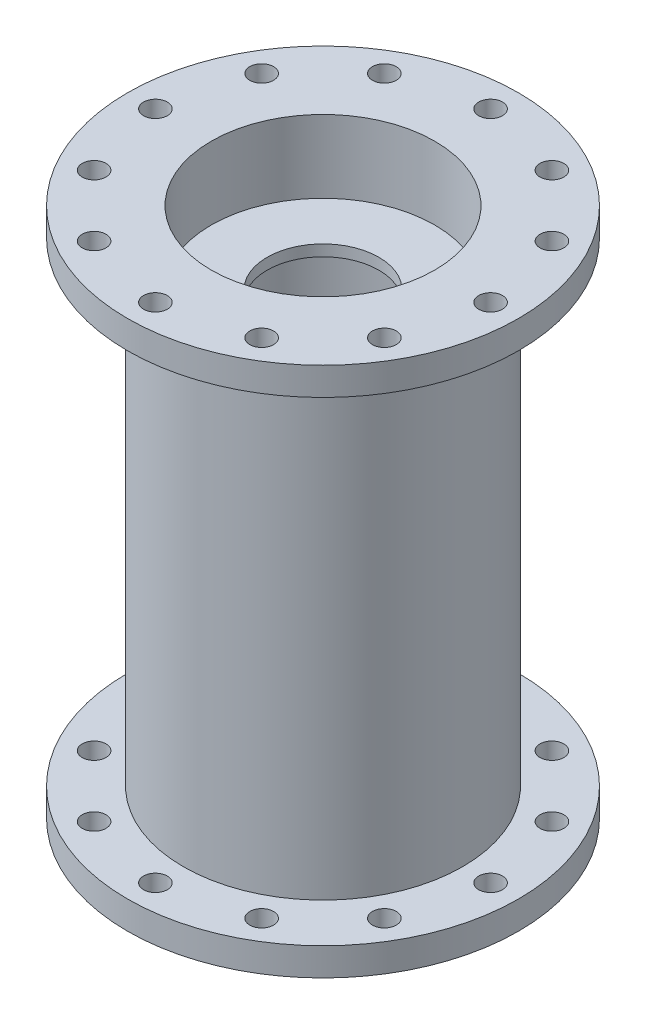
ISO-10303-21;
HEADER;
FILE_DESCRIPTION(('STEP AP214'),'2;1');
FILE_NAME('part.step','',(''),(''),'','','');
FILE_SCHEMA(('AUTOMOTIVE_DESIGN { 1 0 10303 214 1 1 1 1 }'));
ENDSEC;
DATA;
#1=APPLICATION_CONTEXT('core data for automotive mechanical design processes');
#2=APPLICATION_PROTOCOL_DEFINITION('international standard','automotive_design',2000,#1);
#3=PRODUCT_CONTEXT('',#1,'mechanical');
#4=PRODUCT('Part','Part','',(#3));
#5=PRODUCT_RELATED_PRODUCT_CATEGORY('part','',(#4));
#6=PRODUCT_DEFINITION_FORMATION('','',#4);
#7=PRODUCT_DEFINITION_CONTEXT('part definition',#1,'design');
#8=PRODUCT_DEFINITION('design','',#6,#7);
#9=PRODUCT_DEFINITION_SHAPE('','',#8);
#10=(LENGTH_UNIT() NAMED_UNIT(*) SI_UNIT(.MILLI.,.METRE.));
#11=(NAMED_UNIT(*) PLANE_ANGLE_UNIT() SI_UNIT($,.RADIAN.));
#12=(NAMED_UNIT(*) SI_UNIT($,.STERADIAN.) SOLID_ANGLE_UNIT());
#13=UNCERTAINTY_MEASURE_WITH_UNIT(LENGTH_MEASURE(1.E-05),#10,'distance_accuracy_value','');
#14=(GEOMETRIC_REPRESENTATION_CONTEXT(3) GLOBAL_UNCERTAINTY_ASSIGNED_CONTEXT((#13)) GLOBAL_UNIT_ASSIGNED_CONTEXT((#10,
#11,#12)) REPRESENTATION_CONTEXT('',''));
#15=CARTESIAN_POINT('',(0.,0.,0.));
#16=DIRECTION('',(0.,0.,1.));
#17=DIRECTION('',(1.,0.,0.));
#18=AXIS2_PLACEMENT_3D('',#15,#16,#17);
#19=CARTESIAN_POINT('',(0.,0.,0.));
#20=DIRECTION('',(0.,-1.,0.));
#21=DIRECTION('',(0.,0.,-1.));
#22=AXIS2_PLACEMENT_3D('',#19,#20,#21);
#23=CYLINDRICAL_SURFACE('',#22,25.4);
#24=CARTESIAN_POINT('',(0.,101.6,0.));
#25=DIRECTION('',(0.,-1.,0.));
#26=DIRECTION('',(0.,0.,-1.));
#27=AXIS2_PLACEMENT_3D('',#24,#25,#26);
#28=CIRCLE('',#27,25.4);
#29=CARTESIAN_POINT('',(0.,101.6,-25.4));
#30=VERTEX_POINT('',#29);
#31=EDGE_CURVE('E10',#30,#30,#28,.T.);
#32=ORIENTED_EDGE('',*,*,#31,.F.);
#33=EDGE_LOOP('',(#32));
#34=FACE_BOUND('',#33,.T.);
#35=CARTESIAN_POINT('',(0.,19.05,0.));
#36=DIRECTION('',(0.,1.,0.));
#37=DIRECTION('',(0.,0.,1.));
#38=AXIS2_PLACEMENT_3D('',#35,#36,#37);
#39=CIRCLE('',#38,25.4);
#40=CARTESIAN_POINT('',(0.,19.05,25.4));
#41=VERTEX_POINT('',#40);
#42=EDGE_CURVE('E56',#41,#41,#39,.T.);
#43=ORIENTED_EDGE('',*,*,#42,.F.);
#44=EDGE_LOOP('',(#43));
#45=FACE_BOUND('',#44,.T.);
#46=ADVANCED_FACE('F43',(#34,#45),#23,.F.);
#47=CARTESIAN_POINT('',(0.,104.14,0.));
#48=DIRECTION('',(0.,1.,0.));
#49=DIRECTION('',(0.,0.,1.));
#50=AXIS2_PLACEMENT_3D('',#47,#48,#49);
#51=CIRCLE('',#50,25.4);
#52=CARTESIAN_POINT('',(0.,104.14,25.4));
#53=VERTEX_POINT('',#52);
#54=EDGE_CURVE('E51',#53,#53,#51,.T.);
#55=ORIENTED_EDGE('',*,*,#54,.F.);
#56=EDGE_LOOP('',(#55));
#57=FACE_BOUND('',#56,.T.);
#58=CARTESIAN_POINT('',(0.,120.65,0.));
#59=DIRECTION('',(0.,-1.,0.));
#60=DIRECTION('',(0.,0.,-1.));
#61=AXIS2_PLACEMENT_3D('',#58,#59,#60);
#62=CIRCLE('',#61,25.4);
#63=CARTESIAN_POINT('',(0.,120.65,-25.4));
#64=VERTEX_POINT('',#63);
#65=EDGE_CURVE('E91',#64,#64,#62,.T.);
#66=ORIENTED_EDGE('',*,*,#65,.F.);
#67=EDGE_LOOP('',(#66));
#68=FACE_BOUND('',#67,.T.);
#69=ADVANCED_FACE('F374',(#57,#68),#23,.F.);
#70=CARTESIAN_POINT('',(0.,0.,-31.75));
#71=DIRECTION('',(0.,-1.,0.));
#72=DIRECTION('',(0.,0.,-1.));
#73=AXIS2_PLACEMENT_3D('',#70,#71,#72);
#74=PLANE('',#73);
#75=CARTESIAN_POINT('',(-38.1,0.,0.));
#76=DIRECTION('',(0.,1.,0.));
#77=DIRECTION('',(0.,0.,1.));
#78=AXIS2_PLACEMENT_3D('',#75,#76,#77);
#79=CIRCLE('',#78,2.70509999999999);
#80=CARTESIAN_POINT('',(-38.1,0.,2.70509999999998));
#81=VERTEX_POINT('',#80);
#82=EDGE_CURVE('E299',#81,#81,#79,.T.);
#83=ORIENTED_EDGE('',*,*,#82,.T.);
#84=EDGE_LOOP('',(#83));
#85=FACE_BOUND('',#84,.T.);
#86=CARTESIAN_POINT('',(-32.9955678841871,0.,-19.05));
#87=DIRECTION('',(0.,1.,0.));
#88=DIRECTION('',(0.,0.,1.));
#89=AXIS2_PLACEMENT_3D('',#86,#87,#88);
#90=CIRCLE('',#89,2.70509999999998);
#91=CARTESIAN_POINT('',(-32.9955678841871,0.,-16.3449));
#92=VERTEX_POINT('',#91);
#93=EDGE_CURVE('E283',#92,#92,#90,.T.);
#94=ORIENTED_EDGE('',*,*,#93,.T.);
#95=EDGE_LOOP('',(#94));
#96=FACE_BOUND('',#95,.T.);
#97=CARTESIAN_POINT('',(-19.05,0.,-32.9955678841871));
#98=DIRECTION('',(0.,1.,0.));
#99=DIRECTION('',(0.,0.,1.));
#100=AXIS2_PLACEMENT_3D('',#97,#98,#99);
#101=CIRCLE('',#100,2.70509999999998);
#102=CARTESIAN_POINT('',(-19.05,0.,-30.2904678841871));
#103=VERTEX_POINT('',#102);
#104=EDGE_CURVE('E267',#103,#103,#101,.T.);
#105=ORIENTED_EDGE('',*,*,#104,.T.);
#106=EDGE_LOOP('',(#105));
#107=FACE_BOUND('',#106,.T.);
#108=CARTESIAN_POINT('',(0.,0.,-38.1));
#109=DIRECTION('',(0.,1.,0.));
#110=DIRECTION('',(0.,0.,1.));
#111=AXIS2_PLACEMENT_3D('',#108,#109,#110);
#112=CIRCLE('',#111,2.70509999999999);
#113=CARTESIAN_POINT('',(0.,0.,-35.3949));
#114=VERTEX_POINT('',#113);
#115=EDGE_CURVE('E251',#114,#114,#112,.T.);
#116=ORIENTED_EDGE('',*,*,#115,.T.);
#117=EDGE_LOOP('',(#116));
#118=FACE_BOUND('',#117,.T.);
#119=CARTESIAN_POINT('',(19.05,0.,-32.9955678841871));
#120=DIRECTION('',(0.,1.,0.));
#121=DIRECTION('',(0.,0.,1.));
#122=AXIS2_PLACEMENT_3D('',#119,#120,#121);
#123=CIRCLE('',#122,2.70509999999998);
#124=CARTESIAN_POINT('',(19.05,0.,-30.2904678841871));
#125=VERTEX_POINT('',#124);
#126=EDGE_CURVE('E235',#125,#125,#123,.T.);
#127=ORIENTED_EDGE('',*,*,#126,.T.);
#128=EDGE_LOOP('',(#127));
#129=FACE_BOUND('',#128,.T.);
#130=CARTESIAN_POINT('',(32.9955678841871,0.,-19.05));
#131=DIRECTION('',(0.,1.,0.));
#132=DIRECTION('',(0.,0.,1.));
#133=AXIS2_PLACEMENT_3D('',#130,#131,#132);
#134=CIRCLE('',#133,2.70509999999999);
#135=CARTESIAN_POINT('',(32.9955678841871,0.,-16.3449));
#136=VERTEX_POINT('',#135);
#137=EDGE_CURVE('E219',#136,#136,#134,.T.);
#138=ORIENTED_EDGE('',*,*,#137,.T.);
#139=EDGE_LOOP('',(#138));
#140=FACE_BOUND('',#139,.T.);
#141=CARTESIAN_POINT('',(38.1,0.,0.));
#142=DIRECTION('',(0.,1.,0.));
#143=DIRECTION('',(0.,0.,1.));
#144=AXIS2_PLACEMENT_3D('',#141,#142,#143);
#145=CIRCLE('',#144,2.70509999999999);
#146=CARTESIAN_POINT('',(38.1,0.,2.70509999999999));
#147=VERTEX_POINT('',#146);
#148=EDGE_CURVE('E203',#147,#147,#145,.T.);
#149=ORIENTED_EDGE('',*,*,#148,.T.);
#150=EDGE_LOOP('',(#149));
#151=FACE_BOUND('',#150,.T.);
#152=CARTESIAN_POINT('',(32.9955678841871,0.,19.05));
#153=DIRECTION('',(0.,1.,0.));
#154=DIRECTION('',(0.,0.,1.));
#155=AXIS2_PLACEMENT_3D('',#152,#153,#154);
#156=CIRCLE('',#155,2.70509999999999);
#157=CARTESIAN_POINT('',(32.9955678841871,0.,21.7551));
#158=VERTEX_POINT('',#157);
#159=EDGE_CURVE('E187',#158,#158,#156,.T.);
#160=ORIENTED_EDGE('',*,*,#159,.T.);
#161=EDGE_LOOP('',(#160));
#162=FACE_BOUND('',#161,.T.);
#163=CARTESIAN_POINT('',(19.05,0.,32.9955678841871));
#164=DIRECTION('',(0.,1.,0.));
#165=DIRECTION('',(0.,0.,1.));
#166=AXIS2_PLACEMENT_3D('',#163,#164,#165);
#167=CIRCLE('',#166,2.70509999999998);
#168=CARTESIAN_POINT('',(19.05,0.,35.7006678841871));
#169=VERTEX_POINT('',#168);
#170=EDGE_CURVE('E171',#169,#169,#167,.T.);
#171=ORIENTED_EDGE('',*,*,#170,.T.);
#172=EDGE_LOOP('',(#171));
#173=FACE_BOUND('',#172,.T.);
#174=CARTESIAN_POINT('',(0.,0.,38.1));
#175=DIRECTION('',(0.,1.,0.));
#176=DIRECTION('',(0.,0.,1.));
#177=AXIS2_PLACEMENT_3D('',#174,#175,#176);
#178=CIRCLE('',#177,2.70509999999999);
#179=CARTESIAN_POINT('',(0.,0.,40.8051));
#180=VERTEX_POINT('',#179);
#181=EDGE_CURVE('E155',#180,#180,#178,.T.);
#182=ORIENTED_EDGE('',*,*,#181,.T.);
#183=EDGE_LOOP('',(#182));
#184=FACE_BOUND('',#183,.T.);
#185=CARTESIAN_POINT('',(-19.05,0.,32.9955678841871));
#186=DIRECTION('',(0.,1.,0.));
#187=DIRECTION('',(0.,0.,1.));
#188=AXIS2_PLACEMENT_3D('',#185,#186,#187);
#189=CIRCLE('',#188,2.70509999999998);
#190=CARTESIAN_POINT('',(-19.05,0.,35.7006678841871));
#191=VERTEX_POINT('',#190);
#192=EDGE_CURVE('E139',#191,#191,#189,.T.);
#193=ORIENTED_EDGE('',*,*,#192,.T.);
#194=EDGE_LOOP('',(#193));
#195=FACE_BOUND('',#194,.T.);
#196=CARTESIAN_POINT('',(-32.9955678841871,0.,19.05));
#197=DIRECTION('',(0.,1.,0.));
#198=DIRECTION('',(0.,0.,1.));
#199=AXIS2_PLACEMENT_3D('',#196,#197,#198);
#200=CIRCLE('',#199,2.70509999999998);
#201=CARTESIAN_POINT('',(-32.9955678841871,0.,21.7551));
#202=VERTEX_POINT('',#201);
#203=EDGE_CURVE('E123',#202,#202,#200,.T.);
#204=ORIENTED_EDGE('',*,*,#203,.T.);
#205=EDGE_LOOP('',(#204));
#206=FACE_BOUND('',#205,.T.);
#207=CARTESIAN_POINT('',(0.,0.,0.));
#208=DIRECTION('',(0.,-1.,0.));
#209=DIRECTION('',(0.,0.,-1.));
#210=AXIS2_PLACEMENT_3D('',#207,#208,#209);
#211=CIRCLE('',#210,44.45);
#212=CARTESIAN_POINT('',(0.,0.,-44.45));
#213=VERTEX_POINT('',#212);
#214=EDGE_CURVE('E67',#213,#213,#211,.T.);
#215=ORIENTED_EDGE('',*,*,#214,.T.);
#216=EDGE_LOOP('',(#215));
#217=FACE_BOUND('',#216,.T.);
#218=CARTESIAN_POINT('',(0.,0.,0.));
#219=DIRECTION('',(0.,-1.,0.));
#220=DIRECTION('',(0.,0.,-1.));
#221=AXIS2_PLACEMENT_3D('',#218,#219,#220);
#222=CIRCLE('',#221,25.4);
#223=CARTESIAN_POINT('',(0.,0.,-25.4));
#224=VERTEX_POINT('',#223);
#225=EDGE_CURVE('E95',#224,#224,#222,.T.);
#226=ORIENTED_EDGE('',*,*,#225,.F.);
#227=EDGE_LOOP('',(#226));
#228=FACE_BOUND('',#227,.T.);
#229=ADVANCED_FACE('F45',(#85,#96,#107,#118,#129,#140,#151,#162,#173,#184,#195,#206,#217,#228),
#74,.T.);
#230=CARTESIAN_POINT('',(0.,0.,0.));
#231=DIRECTION('',(0.,-1.,0.));
#232=DIRECTION('',(0.,0.,-1.));
#233=AXIS2_PLACEMENT_3D('',#230,#231,#232);
#234=CYLINDRICAL_SURFACE('',#233,44.45);
#235=CARTESIAN_POINT('',(0.,6.35,0.));
#236=DIRECTION('',(0.,-1.,0.));
#237=DIRECTION('',(0.,0.,-1.));
#238=AXIS2_PLACEMENT_3D('',#235,#236,#237);
#239=CIRCLE('',#238,44.45);
#240=CARTESIAN_POINT('',(0.,6.35,-44.45));
#241=VERTEX_POINT('',#240);
#242=EDGE_CURVE('E71',#241,#241,#239,.T.);
#243=ORIENTED_EDGE('',*,*,#242,.T.);
#244=EDGE_LOOP('',(#243));
#245=FACE_BOUND('',#244,.T.);
#246=ORIENTED_EDGE('',*,*,#214,.F.);
#247=EDGE_LOOP('',(#246));
#248=FACE_BOUND('',#247,.T.);
#249=ADVANCED_FACE('F363',(#245,#248),#234,.T.);
#250=CARTESIAN_POINT('',(0.,6.35,-44.45));
#251=DIRECTION('',(0.,1.,0.));
#252=DIRECTION('',(0.,0.,1.));
#253=AXIS2_PLACEMENT_3D('',#250,#251,#252);
#254=PLANE('',#253);
#255=CARTESIAN_POINT('',(-38.1,6.34999999999999,0.));
#256=DIRECTION('',(0.,1.,0.));
#257=DIRECTION('',(0.,0.,1.));
#258=AXIS2_PLACEMENT_3D('',#255,#256,#257);
#259=CIRCLE('',#258,2.70509999999999);
#260=CARTESIAN_POINT('',(-38.1,6.34999999999999,2.70509999999998));
#261=VERTEX_POINT('',#260);
#262=EDGE_CURVE('E291',#261,#261,#259,.T.);
#263=ORIENTED_EDGE('',*,*,#262,.F.);
#264=EDGE_LOOP('',(#263));
#265=FACE_BOUND('',#264,.T.);
#266=CARTESIAN_POINT('',(-32.9955678841871,6.34999999999999,-19.05));
#267=DIRECTION('',(0.,1.,0.));
#268=DIRECTION('',(0.,0.,1.));
#269=AXIS2_PLACEMENT_3D('',#266,#267,#268);
#270=CIRCLE('',#269,2.70509999999999);
#271=CARTESIAN_POINT('',(-32.9955678841871,6.34999999999999,-16.3449));
#272=VERTEX_POINT('',#271);
#273=EDGE_CURVE('E275',#272,#272,#270,.T.);
#274=ORIENTED_EDGE('',*,*,#273,.F.);
#275=EDGE_LOOP('',(#274));
#276=FACE_BOUND('',#275,.T.);
#277=CARTESIAN_POINT('',(-19.05,6.34999999999999,-32.9955678841871));
#278=DIRECTION('',(0.,1.,0.));
#279=DIRECTION('',(0.,0.,1.));
#280=AXIS2_PLACEMENT_3D('',#277,#278,#279);
#281=CIRCLE('',#280,2.70509999999999);
#282=CARTESIAN_POINT('',(-19.05,6.34999999999999,-30.2904678841871));
#283=VERTEX_POINT('',#282);
#284=EDGE_CURVE('E259',#283,#283,#281,.T.);
#285=ORIENTED_EDGE('',*,*,#284,.F.);
#286=EDGE_LOOP('',(#285));
#287=FACE_BOUND('',#286,.T.);
#288=CARTESIAN_POINT('',(0.,6.34999999999999,-38.1));
#289=DIRECTION('',(0.,1.,0.));
#290=DIRECTION('',(0.,0.,1.));
#291=AXIS2_PLACEMENT_3D('',#288,#289,#290);
#292=CIRCLE('',#291,2.70509999999999);
#293=CARTESIAN_POINT('',(0.,6.34999999999999,-35.3949));
#294=VERTEX_POINT('',#293);
#295=EDGE_CURVE('E243',#294,#294,#292,.T.);
#296=ORIENTED_EDGE('',*,*,#295,.F.);
#297=EDGE_LOOP('',(#296));
#298=FACE_BOUND('',#297,.T.);
#299=CARTESIAN_POINT('',(19.05,6.34999999999999,-32.9955678841871));
#300=DIRECTION('',(0.,1.,0.));
#301=DIRECTION('',(0.,0.,1.));
#302=AXIS2_PLACEMENT_3D('',#299,#300,#301);
#303=CIRCLE('',#302,2.70509999999999);
#304=CARTESIAN_POINT('',(19.05,6.34999999999999,-30.2904678841871));
#305=VERTEX_POINT('',#304);
#306=EDGE_CURVE('E227',#305,#305,#303,.T.);
#307=ORIENTED_EDGE('',*,*,#306,.F.);
#308=EDGE_LOOP('',(#307));
#309=FACE_BOUND('',#308,.T.);
#310=CARTESIAN_POINT('',(32.9955678841871,6.34999999999999,-19.05));
#311=DIRECTION('',(0.,1.,0.));
#312=DIRECTION('',(0.,0.,1.));
#313=AXIS2_PLACEMENT_3D('',#310,#311,#312);
#314=CIRCLE('',#313,2.70509999999999);
#315=CARTESIAN_POINT('',(32.9955678841871,6.34999999999999,-16.3449));
#316=VERTEX_POINT('',#315);
#317=EDGE_CURVE('E211',#316,#316,#314,.T.);
#318=ORIENTED_EDGE('',*,*,#317,.F.);
#319=EDGE_LOOP('',(#318));
#320=FACE_BOUND('',#319,.T.);
#321=CARTESIAN_POINT('',(38.1,6.34999999999999,0.));
#322=DIRECTION('',(0.,1.,0.));
#323=DIRECTION('',(0.,0.,1.));
#324=AXIS2_PLACEMENT_3D('',#321,#322,#323);
#325=CIRCLE('',#324,2.70509999999999);
#326=CARTESIAN_POINT('',(38.1,6.34999999999999,2.70509999999999));
#327=VERTEX_POINT('',#326);
#328=EDGE_CURVE('E195',#327,#327,#325,.T.);
#329=ORIENTED_EDGE('',*,*,#328,.F.);
#330=EDGE_LOOP('',(#329));
#331=FACE_BOUND('',#330,.T.);
#332=CARTESIAN_POINT('',(32.9955678841871,6.34999999999999,19.05));
#333=DIRECTION('',(0.,1.,0.));
#334=DIRECTION('',(0.,0.,1.));
#335=AXIS2_PLACEMENT_3D('',#332,#333,#334);
#336=CIRCLE('',#335,2.70509999999999);
#337=CARTESIAN_POINT('',(32.9955678841871,6.34999999999999,21.7551));
#338=VERTEX_POINT('',#337);
#339=EDGE_CURVE('E179',#338,#338,#336,.T.);
#340=ORIENTED_EDGE('',*,*,#339,.F.);
#341=EDGE_LOOP('',(#340));
#342=FACE_BOUND('',#341,.T.);
#343=CARTESIAN_POINT('',(19.05,6.34999999999999,32.9955678841871));
#344=DIRECTION('',(0.,1.,0.));
#345=DIRECTION('',(0.,0.,1.));
#346=AXIS2_PLACEMENT_3D('',#343,#344,#345);
#347=CIRCLE('',#346,2.70509999999999);
#348=CARTESIAN_POINT('',(19.05,6.34999999999999,35.7006678841871));
#349=VERTEX_POINT('',#348);
#350=EDGE_CURVE('E167',#349,#349,#347,.T.);
#351=ORIENTED_EDGE('',*,*,#350,.F.);
#352=EDGE_LOOP('',(#351));
#353=FACE_BOUND('',#352,.T.);
#354=CARTESIAN_POINT('',(0.,6.34999999999999,38.1));
#355=DIRECTION('',(0.,1.,0.));
#356=DIRECTION('',(0.,0.,1.));
#357=AXIS2_PLACEMENT_3D('',#354,#355,#356);
#358=CIRCLE('',#357,2.70509999999999);
#359=CARTESIAN_POINT('',(0.,6.34999999999999,40.8051));
#360=VERTEX_POINT('',#359);
#361=EDGE_CURVE('E147',#360,#360,#358,.T.);
#362=ORIENTED_EDGE('',*,*,#361,.F.);
#363=EDGE_LOOP('',(#362));
#364=FACE_BOUND('',#363,.T.);
#365=CARTESIAN_POINT('',(-19.05,6.34999999999999,32.9955678841871));
#366=DIRECTION('',(0.,1.,0.));
#367=DIRECTION('',(0.,0.,1.));
#368=AXIS2_PLACEMENT_3D('',#365,#366,#367);
#369=CIRCLE('',#368,2.70509999999999);
#370=CARTESIAN_POINT('',(-19.05,6.34999999999999,35.7006678841871));
#371=VERTEX_POINT('',#370);
#372=EDGE_CURVE('E131',#371,#371,#369,.T.);
#373=ORIENTED_EDGE('',*,*,#372,.F.);
#374=EDGE_LOOP('',(#373));
#375=FACE_BOUND('',#374,.T.);
#376=CARTESIAN_POINT('',(-32.9955678841871,6.34999999999999,19.05));
#377=DIRECTION('',(0.,1.,0.));
#378=DIRECTION('',(0.,0.,1.));
#379=AXIS2_PLACEMENT_3D('',#376,#377,#378);
#380=CIRCLE('',#379,2.70509999999999);
#381=CARTESIAN_POINT('',(-32.9955678841871,6.34999999999999,21.7551));
#382=VERTEX_POINT('',#381);
#383=EDGE_CURVE('E115',#382,#382,#380,.T.);
#384=ORIENTED_EDGE('',*,*,#383,.F.);
#385=EDGE_LOOP('',(#384));
#386=FACE_BOUND('',#385,.T.);
#387=CARTESIAN_POINT('',(0.,6.35,0.));
#388=DIRECTION('',(0.,-1.,0.));
#389=DIRECTION('',(0.,0.,-1.));
#390=AXIS2_PLACEMENT_3D('',#387,#388,#389);
#391=CIRCLE('',#390,31.75);
#392=CARTESIAN_POINT('',(0.,6.35,-31.75));
#393=VERTEX_POINT('',#392);
#394=EDGE_CURVE('E75',#393,#393,#391,.T.);
#395=ORIENTED_EDGE('',*,*,#394,.T.);
#396=EDGE_LOOP('',(#395));
#397=FACE_BOUND('',#396,.T.);
#398=ORIENTED_EDGE('',*,*,#242,.F.);
#399=EDGE_LOOP('',(#398));
#400=FACE_BOUND('',#399,.T.);
#401=ADVANCED_FACE('F357',(#265,#276,#287,#298,#309,#320,#331,#342,#353,#364,#375,#386,#397,
#400),#254,.T.);
#402=CARTESIAN_POINT('',(0.,0.,0.));
#403=DIRECTION('',(0.,-1.,0.));
#404=DIRECTION('',(0.,0.,-1.));
#405=AXIS2_PLACEMENT_3D('',#402,#403,#404);
#406=CYLINDRICAL_SURFACE('',#405,31.75);
#407=CARTESIAN_POINT('',(0.,114.3,0.));
#408=DIRECTION('',(0.,-1.,0.));
#409=DIRECTION('',(0.,0.,-1.));
#410=AXIS2_PLACEMENT_3D('',#407,#408,#409);
#411=CIRCLE('',#410,31.75);
#412=CARTESIAN_POINT('',(0.,114.3,-31.75));
#413=VERTEX_POINT('',#412);
#414=EDGE_CURVE('E79',#413,#413,#411,.T.);
#415=ORIENTED_EDGE('',*,*,#414,.T.);
#416=EDGE_LOOP('',(#415));
#417=FACE_BOUND('',#416,.T.);
#418=ORIENTED_EDGE('',*,*,#394,.F.);
#419=EDGE_LOOP('',(#418));
#420=FACE_BOUND('',#419,.T.);
#421=ADVANCED_FACE('F350',(#417,#420),#406,.T.);
#422=CARTESIAN_POINT('',(0.,114.3,-44.45));
#423=DIRECTION('',(0.,-1.,0.));
#424=DIRECTION('',(0.,0.,-1.));
#425=AXIS2_PLACEMENT_3D('',#422,#423,#424);
#426=PLANE('',#425);
#427=CARTESIAN_POINT('',(-38.1,114.3,0.));
#428=DIRECTION('',(0.,-1.,0.));
#429=DIRECTION('',(0.,0.,-1.));
#430=AXIS2_PLACEMENT_3D('',#427,#428,#429);
#431=CIRCLE('',#430,2.70509999999999);
#432=CARTESIAN_POINT('',(-38.1,114.3,-2.70509999999999));
#433=VERTEX_POINT('',#432);
#434=EDGE_CURVE('E295',#433,#433,#431,.T.);
#435=ORIENTED_EDGE('',*,*,#434,.F.);
#436=EDGE_LOOP('',(#435));
#437=FACE_BOUND('',#436,.T.);
#438=CARTESIAN_POINT('',(-32.9955678841871,114.3,-19.05));
#439=DIRECTION('',(0.,-1.,0.));
#440=DIRECTION('',(0.,0.,-1.));
#441=AXIS2_PLACEMENT_3D('',#438,#439,#440);
#442=CIRCLE('',#441,2.70509999999999);
#443=CARTESIAN_POINT('',(-32.9955678841871,114.3,-21.7551));
#444=VERTEX_POINT('',#443);
#445=EDGE_CURVE('E279',#444,#444,#442,.T.);
#446=ORIENTED_EDGE('',*,*,#445,.F.);
#447=EDGE_LOOP('',(#446));
#448=FACE_BOUND('',#447,.T.);
#449=CARTESIAN_POINT('',(-19.05,114.3,-32.9955678841871));
#450=DIRECTION('',(0.,-1.,0.));
#451=DIRECTION('',(0.,0.,-1.));
#452=AXIS2_PLACEMENT_3D('',#449,#450,#451);
#453=CIRCLE('',#452,2.70509999999999);
#454=CARTESIAN_POINT('',(-19.05,114.3,-35.7006678841871));
#455=VERTEX_POINT('',#454);
#456=EDGE_CURVE('E263',#455,#455,#453,.T.);
#457=ORIENTED_EDGE('',*,*,#456,.F.);
#458=EDGE_LOOP('',(#457));
#459=FACE_BOUND('',#458,.T.);
#460=CARTESIAN_POINT('',(0.,114.3,-38.1));
#461=DIRECTION('',(0.,-1.,0.));
#462=DIRECTION('',(0.,0.,-1.));
#463=AXIS2_PLACEMENT_3D('',#460,#461,#462);
#464=CIRCLE('',#463,2.70509999999999);
#465=CARTESIAN_POINT('',(0.,114.3,-40.8051));
#466=VERTEX_POINT('',#465);
#467=EDGE_CURVE('E247',#466,#466,#464,.T.);
#468=ORIENTED_EDGE('',*,*,#467,.F.);
#469=EDGE_LOOP('',(#468));
#470=FACE_BOUND('',#469,.T.);
#471=CARTESIAN_POINT('',(19.05,114.3,-32.9955678841871));
#472=DIRECTION('',(0.,-1.,0.));
#473=DIRECTION('',(0.,0.,-1.));
#474=AXIS2_PLACEMENT_3D('',#471,#472,#473);
#475=CIRCLE('',#474,2.70509999999999);
#476=CARTESIAN_POINT('',(19.05,114.3,-35.7006678841871));
#477=VERTEX_POINT('',#476);
#478=EDGE_CURVE('E231',#477,#477,#475,.T.);
#479=ORIENTED_EDGE('',*,*,#478,.F.);
#480=EDGE_LOOP('',(#479));
#481=FACE_BOUND('',#480,.T.);
#482=CARTESIAN_POINT('',(32.9955678841871,114.3,-19.05));
#483=DIRECTION('',(0.,-1.,0.));
#484=DIRECTION('',(0.,0.,-1.));
#485=AXIS2_PLACEMENT_3D('',#482,#483,#484);
#486=CIRCLE('',#485,2.70509999999999);
#487=CARTESIAN_POINT('',(32.9955678841871,114.3,-21.7551));
#488=VERTEX_POINT('',#487);
#489=EDGE_CURVE('E215',#488,#488,#486,.T.);
#490=ORIENTED_EDGE('',*,*,#489,.F.);
#491=EDGE_LOOP('',(#490));
#492=FACE_BOUND('',#491,.T.);
#493=CARTESIAN_POINT('',(38.1,114.3,0.));
#494=DIRECTION('',(0.,-1.,0.));
#495=DIRECTION('',(0.,0.,-1.));
#496=AXIS2_PLACEMENT_3D('',#493,#494,#495);
#497=CIRCLE('',#496,2.70509999999999);
#498=CARTESIAN_POINT('',(38.1,114.3,-2.70509999999999));
#499=VERTEX_POINT('',#498);
#500=EDGE_CURVE('E199',#499,#499,#497,.T.);
#501=ORIENTED_EDGE('',*,*,#500,.F.);
#502=EDGE_LOOP('',(#501));
#503=FACE_BOUND('',#502,.T.);
#504=CARTESIAN_POINT('',(32.9955678841871,114.3,19.05));
#505=DIRECTION('',(0.,-1.,0.));
#506=DIRECTION('',(0.,0.,-1.));
#507=AXIS2_PLACEMENT_3D('',#504,#505,#506);
#508=CIRCLE('',#507,2.70509999999999);
#509=CARTESIAN_POINT('',(32.9955678841871,114.3,16.3449));
#510=VERTEX_POINT('',#509);
#511=EDGE_CURVE('E183',#510,#510,#508,.T.);
#512=ORIENTED_EDGE('',*,*,#511,.F.);
#513=EDGE_LOOP('',(#512));
#514=FACE_BOUND('',#513,.T.);
#515=CARTESIAN_POINT('',(19.05,114.3,32.9955678841871));
#516=DIRECTION('',(0.,-1.,0.));
#517=DIRECTION('',(0.,0.,-1.));
#518=AXIS2_PLACEMENT_3D('',#515,#516,#517);
#519=CIRCLE('',#518,2.70509999999999);
#520=CARTESIAN_POINT('',(19.05,114.3,30.2904678841871));
#521=VERTEX_POINT('',#520);
#522=EDGE_CURVE('E163',#521,#521,#519,.T.);
#523=ORIENTED_EDGE('',*,*,#522,.F.);
#524=EDGE_LOOP('',(#523));
#525=FACE_BOUND('',#524,.T.);
#526=CARTESIAN_POINT('',(0.,114.3,38.1));
#527=DIRECTION('',(0.,-1.,0.));
#528=DIRECTION('',(0.,0.,-1.));
#529=AXIS2_PLACEMENT_3D('',#526,#527,#528);
#530=CIRCLE('',#529,2.70509999999999);
#531=CARTESIAN_POINT('',(0.,114.3,35.3949));
#532=VERTEX_POINT('',#531);
#533=EDGE_CURVE('E151',#532,#532,#530,.T.);
#534=ORIENTED_EDGE('',*,*,#533,.F.);
#535=EDGE_LOOP('',(#534));
#536=FACE_BOUND('',#535,.T.);
#537=CARTESIAN_POINT('',(-19.05,114.3,32.9955678841871));
#538=DIRECTION('',(0.,-1.,0.));
#539=DIRECTION('',(0.,0.,-1.));
#540=AXIS2_PLACEMENT_3D('',#537,#538,#539);
#541=CIRCLE('',#540,2.70509999999999);
#542=CARTESIAN_POINT('',(-19.05,114.3,30.2904678841871));
#543=VERTEX_POINT('',#542);
#544=EDGE_CURVE('E135',#543,#543,#541,.T.);
#545=ORIENTED_EDGE('',*,*,#544,.F.);
#546=EDGE_LOOP('',(#545));
#547=FACE_BOUND('',#546,.T.);
#548=CARTESIAN_POINT('',(-32.9955678841871,114.3,19.05));
#549=DIRECTION('',(0.,-1.,0.));
#550=DIRECTION('',(0.,0.,-1.));
#551=AXIS2_PLACEMENT_3D('',#548,#549,#550);
#552=CIRCLE('',#551,2.70509999999999);
#553=CARTESIAN_POINT('',(-32.9955678841871,114.3,16.3449));
#554=VERTEX_POINT('',#553);
#555=EDGE_CURVE('E119',#554,#554,#552,.T.);
#556=ORIENTED_EDGE('',*,*,#555,.F.);
#557=EDGE_LOOP('',(#556));
#558=FACE_BOUND('',#557,.T.);
#559=CARTESIAN_POINT('',(0.,114.3,0.));
#560=DIRECTION('',(0.,-1.,0.));
#561=DIRECTION('',(0.,0.,-1.));
#562=AXIS2_PLACEMENT_3D('',#559,#560,#561);
#563=CIRCLE('',#562,44.45);
#564=CARTESIAN_POINT('',(0.,114.3,-44.45));
#565=VERTEX_POINT('',#564);
#566=EDGE_CURVE('E83',#565,#565,#563,.T.);
#567=ORIENTED_EDGE('',*,*,#566,.T.);
#568=EDGE_LOOP('',(#567));
#569=FACE_BOUND('',#568,.T.);
#570=ORIENTED_EDGE('',*,*,#414,.F.);
#571=EDGE_LOOP('',(#570));
#572=FACE_BOUND('',#571,.T.);
#573=ADVANCED_FACE('F344',(#437,#448,#459,#470,#481,#492,#503,#514,#525,#536,#547,#558,#569,
#572),#426,.T.);
#574=CARTESIAN_POINT('',(0.,0.,0.));
#575=DIRECTION('',(0.,-1.,0.));
#576=DIRECTION('',(0.,0.,-1.));
#577=AXIS2_PLACEMENT_3D('',#574,#575,#576);
#578=CYLINDRICAL_SURFACE('',#577,44.45);
#579=CARTESIAN_POINT('',(0.,120.65,0.));
#580=DIRECTION('',(0.,-1.,0.));
#581=DIRECTION('',(0.,0.,-1.));
#582=AXIS2_PLACEMENT_3D('',#579,#580,#581);
#583=CIRCLE('',#582,44.45);
#584=CARTESIAN_POINT('',(0.,120.65,-44.45));
#585=VERTEX_POINT('',#584);
#586=EDGE_CURVE('E87',#585,#585,#583,.T.);
#587=ORIENTED_EDGE('',*,*,#586,.T.);
#588=EDGE_LOOP('',(#587));
#589=FACE_BOUND('',#588,.T.);
#590=ORIENTED_EDGE('',*,*,#566,.F.);
#591=EDGE_LOOP('',(#590));
#592=FACE_BOUND('',#591,.T.);
#593=ADVANCED_FACE('F314',(#589,#592),#578,.T.);
#594=CARTESIAN_POINT('',(0.,120.65,-25.4));
#595=DIRECTION('',(0.,1.,0.));
#596=DIRECTION('',(0.,0.,1.));
#597=AXIS2_PLACEMENT_3D('',#594,#595,#596);
#598=PLANE('',#597);
#599=CARTESIAN_POINT('',(-38.1,120.65,0.));
#600=DIRECTION('',(0.,1.,0.));
#601=DIRECTION('',(0.,0.,1.));
#602=AXIS2_PLACEMENT_3D('',#599,#600,#601);
#603=CIRCLE('',#602,2.70509999999999);
#604=CARTESIAN_POINT('',(-38.1,120.65,2.70509999999998));
#605=VERTEX_POINT('',#604);
#606=EDGE_CURVE('E303',#605,#605,#603,.T.);
#607=ORIENTED_EDGE('',*,*,#606,.F.);
#608=EDGE_LOOP('',(#607));
#609=FACE_BOUND('',#608,.T.);
#610=CARTESIAN_POINT('',(-32.9955678841871,120.65,-19.05));
#611=DIRECTION('',(0.,1.,0.));
#612=DIRECTION('',(0.,0.,1.));
#613=AXIS2_PLACEMENT_3D('',#610,#611,#612);
#614=CIRCLE('',#613,2.70509999999999);
#615=CARTESIAN_POINT('',(-32.9955678841871,120.65,-16.3449));
#616=VERTEX_POINT('',#615);
#617=EDGE_CURVE('E287',#616,#616,#614,.T.);
#618=ORIENTED_EDGE('',*,*,#617,.F.);
#619=EDGE_LOOP('',(#618));
#620=FACE_BOUND('',#619,.T.);
#621=CARTESIAN_POINT('',(-19.05,120.65,-32.9955678841871));
#622=DIRECTION('',(0.,1.,0.));
#623=DIRECTION('',(0.,0.,1.));
#624=AXIS2_PLACEMENT_3D('',#621,#622,#623);
#625=CIRCLE('',#624,2.70509999999999);
#626=CARTESIAN_POINT('',(-19.05,120.65,-30.2904678841871));
#627=VERTEX_POINT('',#626);
#628=EDGE_CURVE('E271',#627,#627,#625,.T.);
#629=ORIENTED_EDGE('',*,*,#628,.F.);
#630=EDGE_LOOP('',(#629));
#631=FACE_BOUND('',#630,.T.);
#632=CARTESIAN_POINT('',(0.,120.65,-38.1));
#633=DIRECTION('',(0.,1.,0.));
#634=DIRECTION('',(0.,0.,1.));
#635=AXIS2_PLACEMENT_3D('',#632,#633,#634);
#636=CIRCLE('',#635,2.70509999999999);
#637=CARTESIAN_POINT('',(0.,120.65,-35.3949));
#638=VERTEX_POINT('',#637);
#639=EDGE_CURVE('E255',#638,#638,#636,.T.);
#640=ORIENTED_EDGE('',*,*,#639,.F.);
#641=EDGE_LOOP('',(#640));
#642=FACE_BOUND('',#641,.T.);
#643=CARTESIAN_POINT('',(19.05,120.65,-32.9955678841871));
#644=DIRECTION('',(0.,1.,0.));
#645=DIRECTION('',(0.,0.,1.));
#646=AXIS2_PLACEMENT_3D('',#643,#644,#645);
#647=CIRCLE('',#646,2.70509999999999);
#648=CARTESIAN_POINT('',(19.05,120.65,-30.2904678841871));
#649=VERTEX_POINT('',#648);
#650=EDGE_CURVE('E239',#649,#649,#647,.T.);
#651=ORIENTED_EDGE('',*,*,#650,.F.);
#652=EDGE_LOOP('',(#651));
#653=FACE_BOUND('',#652,.T.);
#654=CARTESIAN_POINT('',(32.9955678841871,120.65,-19.05));
#655=DIRECTION('',(0.,1.,0.));
#656=DIRECTION('',(0.,0.,1.));
#657=AXIS2_PLACEMENT_3D('',#654,#655,#656);
#658=CIRCLE('',#657,2.70509999999999);
#659=CARTESIAN_POINT('',(32.9955678841871,120.65,-16.3449));
#660=VERTEX_POINT('',#659);
#661=EDGE_CURVE('E223',#660,#660,#658,.T.);
#662=ORIENTED_EDGE('',*,*,#661,.F.);
#663=EDGE_LOOP('',(#662));
#664=FACE_BOUND('',#663,.T.);
#665=CARTESIAN_POINT('',(38.1,120.65,0.));
#666=DIRECTION('',(0.,1.,0.));
#667=DIRECTION('',(0.,0.,1.));
#668=AXIS2_PLACEMENT_3D('',#665,#666,#667);
#669=CIRCLE('',#668,2.70509999999999);
#670=CARTESIAN_POINT('',(38.1,120.65,2.70509999999999));
#671=VERTEX_POINT('',#670);
#672=EDGE_CURVE('E207',#671,#671,#669,.T.);
#673=ORIENTED_EDGE('',*,*,#672,.F.);
#674=EDGE_LOOP('',(#673));
#675=FACE_BOUND('',#674,.T.);
#676=CARTESIAN_POINT('',(32.9955678841871,120.65,19.05));
#677=DIRECTION('',(0.,1.,0.));
#678=DIRECTION('',(0.,0.,1.));
#679=AXIS2_PLACEMENT_3D('',#676,#677,#678);
#680=CIRCLE('',#679,2.70509999999999);
#681=CARTESIAN_POINT('',(32.9955678841871,120.65,21.7551));
#682=VERTEX_POINT('',#681);
#683=EDGE_CURVE('E191',#682,#682,#680,.T.);
#684=ORIENTED_EDGE('',*,*,#683,.F.);
#685=EDGE_LOOP('',(#684));
#686=FACE_BOUND('',#685,.T.);
#687=CARTESIAN_POINT('',(19.05,120.65,32.9955678841871));
#688=DIRECTION('',(0.,1.,0.));
#689=DIRECTION('',(0.,0.,1.));
#690=AXIS2_PLACEMENT_3D('',#687,#688,#689);
#691=CIRCLE('',#690,2.70509999999999);
#692=CARTESIAN_POINT('',(19.05,120.65,35.7006678841871));
#693=VERTEX_POINT('',#692);
#694=EDGE_CURVE('E175',#693,#693,#691,.T.);
#695=ORIENTED_EDGE('',*,*,#694,.F.);
#696=EDGE_LOOP('',(#695));
#697=FACE_BOUND('',#696,.T.);
#698=CARTESIAN_POINT('',(0.,120.65,38.1));
#699=DIRECTION('',(0.,1.,0.));
#700=DIRECTION('',(0.,0.,1.));
#701=AXIS2_PLACEMENT_3D('',#698,#699,#700);
#702=CIRCLE('',#701,2.70509999999999);
#703=CARTESIAN_POINT('',(0.,120.65,40.8051));
#704=VERTEX_POINT('',#703);
#705=EDGE_CURVE('E159',#704,#704,#702,.T.);
#706=ORIENTED_EDGE('',*,*,#705,.F.);
#707=EDGE_LOOP('',(#706));
#708=FACE_BOUND('',#707,.T.);
#709=CARTESIAN_POINT('',(-19.05,120.65,32.9955678841871));
#710=DIRECTION('',(0.,1.,0.));
#711=DIRECTION('',(0.,0.,1.));
#712=AXIS2_PLACEMENT_3D('',#709,#710,#711);
#713=CIRCLE('',#712,2.70509999999999);
#714=CARTESIAN_POINT('',(-19.05,120.65,35.7006678841871));
#715=VERTEX_POINT('',#714);
#716=EDGE_CURVE('E143',#715,#715,#713,.T.);
#717=ORIENTED_EDGE('',*,*,#716,.F.);
#718=EDGE_LOOP('',(#717));
#719=FACE_BOUND('',#718,.T.);
#720=CARTESIAN_POINT('',(-32.9955678841871,120.65,19.05));
#721=DIRECTION('',(0.,1.,0.));
#722=DIRECTION('',(0.,0.,1.));
#723=AXIS2_PLACEMENT_3D('',#720,#721,#722);
#724=CIRCLE('',#723,2.70509999999999);
#725=CARTESIAN_POINT('',(-32.9955678841871,120.65,21.7551));
#726=VERTEX_POINT('',#725);
#727=EDGE_CURVE('E127',#726,#726,#724,.T.);
#728=ORIENTED_EDGE('',*,*,#727,.F.);
#729=EDGE_LOOP('',(#728));
#730=FACE_BOUND('',#729,.T.);
#731=ORIENTED_EDGE('',*,*,#65,.T.);
#732=EDGE_LOOP('',(#731));
#733=FACE_BOUND('',#732,.T.);
#734=ORIENTED_EDGE('',*,*,#586,.F.);
#735=EDGE_LOOP('',(#734));
#736=FACE_BOUND('',#735,.T.);
#737=ADVANCED_FACE('F310',(#609,#620,#631,#642,#653,#664,#675,#686,#697,#708,#719,#730,#733,
#736),#598,.T.);
#738=CARTESIAN_POINT('',(0.,16.51,0.));
#739=DIRECTION('',(0.,-1.,0.));
#740=DIRECTION('',(0.,0.,-1.));
#741=AXIS2_PLACEMENT_3D('',#738,#739,#740);
#742=CIRCLE('',#741,25.4);
#743=CARTESIAN_POINT('',(0.,16.51,-25.4));
#744=VERTEX_POINT('',#743);
#745=EDGE_CURVE('E61',#744,#744,#742,.T.);
#746=ORIENTED_EDGE('',*,*,#745,.F.);
#747=EDGE_LOOP('',(#746));
#748=FACE_BOUND('',#747,.T.);
#749=ORIENTED_EDGE('',*,*,#225,.T.);
#750=EDGE_LOOP('',(#749));
#751=FACE_BOUND('',#750,.T.);
#752=ADVANCED_FACE('F313',(#748,#751),#23,.F.);
#753=CARTESIAN_POINT('',(0.,19.05,-25.4));
#754=DIRECTION('',(0.,1.,0.));
#755=DIRECTION('',(0.,0.,1.));
#756=AXIS2_PLACEMENT_3D('',#753,#754,#755);
#757=PLANE('',#756);
#758=CARTESIAN_POINT('',(0.,19.05,0.));
#759=DIRECTION('',(0.,-1.,0.));
#760=DIRECTION('',(0.,0.,-1.));
#761=AXIS2_PLACEMENT_3D('',#758,#759,#760);
#762=CIRCLE('',#761,12.7);
#763=CARTESIAN_POINT('',(0.,19.05,-12.7));
#764=VERTEX_POINT('',#763);
#765=EDGE_CURVE('E99',#764,#764,#762,.T.);
#766=ORIENTED_EDGE('',*,*,#765,.T.);
#767=EDGE_LOOP('',(#766));
#768=FACE_BOUND('',#767,.T.);
#769=ORIENTED_EDGE('',*,*,#42,.T.);
#770=EDGE_LOOP('',(#769));
#771=FACE_BOUND('',#770,.T.);
#772=ADVANCED_FACE('F379',(#768,#771),#757,.T.);
#773=CARTESIAN_POINT('',(0.,0.,0.));
#774=DIRECTION('',(0.,-1.,0.));
#775=DIRECTION('',(0.,0.,-1.));
#776=AXIS2_PLACEMENT_3D('',#773,#774,#775);
#777=CYLINDRICAL_SURFACE('',#776,12.7);
#778=CARTESIAN_POINT('',(0.,16.51,0.));
#779=DIRECTION('',(0.,-1.,0.));
#780=DIRECTION('',(0.,0.,-1.));
#781=AXIS2_PLACEMENT_3D('',#778,#779,#780);
#782=CIRCLE('',#781,12.7);
#783=CARTESIAN_POINT('',(0.,16.51,-12.7));
#784=VERTEX_POINT('',#783);
#785=EDGE_CURVE('E103',#784,#784,#782,.T.);
#786=ORIENTED_EDGE('',*,*,#785,.T.);
#787=EDGE_LOOP('',(#786));
#788=FACE_BOUND('',#787,.T.);
#789=ORIENTED_EDGE('',*,*,#765,.F.);
#790=EDGE_LOOP('',(#789));
#791=FACE_BOUND('',#790,.T.);
#792=ADVANCED_FACE('F386',(#788,#791),#777,.F.);
#793=CARTESIAN_POINT('',(0.,16.51,-25.4));
#794=DIRECTION('',(0.,-1.,0.));
#795=DIRECTION('',(0.,0.,-1.));
#796=AXIS2_PLACEMENT_3D('',#793,#794,#795);
#797=PLANE('',#796);
#798=ORIENTED_EDGE('',*,*,#745,.T.);
#799=EDGE_LOOP('',(#798));
#800=FACE_BOUND('',#799,.T.);
#801=ORIENTED_EDGE('',*,*,#785,.F.);
#802=EDGE_LOOP('',(#801));
#803=FACE_BOUND('',#802,.T.);
#804=ADVANCED_FACE('F696',(#800,#803),#797,.T.);
#805=CARTESIAN_POINT('',(0.,101.6,-25.4));
#806=DIRECTION('',(0.,-1.,0.));
#807=DIRECTION('',(0.,0.,-1.));
#808=AXIS2_PLACEMENT_3D('',#805,#806,#807);
#809=PLANE('',#808);
#810=ORIENTED_EDGE('',*,*,#31,.T.);
#811=EDGE_LOOP('',(#810));
#812=FACE_BOUND('',#811,.T.);
#813=CARTESIAN_POINT('',(0.,101.6,0.));
#814=DIRECTION('',(0.,-1.,0.));
#815=DIRECTION('',(0.,0.,-1.));
#816=AXIS2_PLACEMENT_3D('',#813,#814,#815);
#817=CIRCLE('',#816,12.7);
#818=CARTESIAN_POINT('',(0.,101.6,-12.7));
#819=VERTEX_POINT('',#818);
#820=EDGE_CURVE('E107',#819,#819,#817,.T.);
#821=ORIENTED_EDGE('',*,*,#820,.F.);
#822=EDGE_LOOP('',(#821));
#823=FACE_BOUND('',#822,.T.);
#824=ADVANCED_FACE('F687',(#812,#823),#809,.T.);
#825=CARTESIAN_POINT('',(0.,0.,0.));
#826=DIRECTION('',(0.,-1.,0.));
#827=DIRECTION('',(0.,0.,-1.));
#828=AXIS2_PLACEMENT_3D('',#825,#826,#827);
#829=CYLINDRICAL_SURFACE('',#828,12.7);
#830=ORIENTED_EDGE('',*,*,#820,.T.);
#831=EDGE_LOOP('',(#830));
#832=FACE_BOUND('',#831,.T.);
#833=CARTESIAN_POINT('',(0.,104.14,0.));
#834=DIRECTION('',(0.,-1.,0.));
#835=DIRECTION('',(0.,0.,-1.));
#836=AXIS2_PLACEMENT_3D('',#833,#834,#835);
#837=CIRCLE('',#836,12.7);
#838=CARTESIAN_POINT('',(0.,104.14,-12.7));
#839=VERTEX_POINT('',#838);
#840=EDGE_CURVE('E111',#839,#839,#837,.T.);
#841=ORIENTED_EDGE('',*,*,#840,.F.);
#842=EDGE_LOOP('',(#841));
#843=FACE_BOUND('',#842,.T.);
#844=ADVANCED_FACE('F678',(#832,#843),#829,.F.);
#845=CARTESIAN_POINT('',(0.,104.14,-25.4));
#846=DIRECTION('',(0.,1.,0.));
#847=DIRECTION('',(0.,0.,1.));
#848=AXIS2_PLACEMENT_3D('',#845,#846,#847);
#849=PLANE('',#848);
#850=ORIENTED_EDGE('',*,*,#840,.T.);
#851=EDGE_LOOP('',(#850));
#852=FACE_BOUND('',#851,.T.);
#853=ORIENTED_EDGE('',*,*,#54,.T.);
#854=EDGE_LOOP('',(#853));
#855=FACE_BOUND('',#854,.T.);
#856=ADVANCED_FACE('F452',(#852,#855),#849,.T.);
#857=CARTESIAN_POINT('',(-32.9955678841871,120.65,19.05));
#858=DIRECTION('',(0.,1.,0.));
#859=DIRECTION('',(0.,0.,1.));
#860=AXIS2_PLACEMENT_3D('',#857,#858,#859);
#861=CYLINDRICAL_SURFACE('',#860,2.70509999999999);
#862=ORIENTED_EDGE('',*,*,#555,.T.);
#863=EDGE_LOOP('',(#862));
#864=FACE_BOUND('',#863,.T.);
#865=ORIENTED_EDGE('',*,*,#727,.T.);
#866=EDGE_LOOP('',(#865));
#867=FACE_BOUND('',#866,.T.);
#868=ADVANCED_FACE('F447',(#864,#867),#861,.F.);
#869=ORIENTED_EDGE('',*,*,#383,.T.);
#870=EDGE_LOOP('',(#869));
#871=FACE_BOUND('',#870,.T.);
#872=ORIENTED_EDGE('',*,*,#203,.F.);
#873=EDGE_LOOP('',(#872));
#874=FACE_BOUND('',#873,.T.);
#875=ADVANCED_FACE('F451',(#871,#874),#861,.F.);
#876=CARTESIAN_POINT('',(-19.05,120.65,32.9955678841871));
#877=DIRECTION('',(0.,1.,0.));
#878=DIRECTION('',(0.,0.,1.));
#879=AXIS2_PLACEMENT_3D('',#876,#877,#878);
#880=CYLINDRICAL_SURFACE('',#879,2.70509999999999);
#881=ORIENTED_EDGE('',*,*,#544,.T.);
#882=EDGE_LOOP('',(#881));
#883=FACE_BOUND('',#882,.T.);
#884=ORIENTED_EDGE('',*,*,#716,.T.);
#885=EDGE_LOOP('',(#884));
#886=FACE_BOUND('',#885,.T.);
#887=ADVANCED_FACE('F462',(#883,#886),#880,.F.);
#888=ORIENTED_EDGE('',*,*,#372,.T.);
#889=EDGE_LOOP('',(#888));
#890=FACE_BOUND('',#889,.T.);
#891=ORIENTED_EDGE('',*,*,#192,.F.);
#892=EDGE_LOOP('',(#891));
#893=FACE_BOUND('',#892,.T.);
#894=ADVANCED_FACE('F470',(#890,#893),#880,.F.);
#895=CARTESIAN_POINT('',(0.,120.65,38.1));
#896=DIRECTION('',(0.,1.,0.));
#897=DIRECTION('',(0.,0.,1.));
#898=AXIS2_PLACEMENT_3D('',#895,#896,#897);
#899=CYLINDRICAL_SURFACE('',#898,2.70509999999999);
#900=ORIENTED_EDGE('',*,*,#533,.T.);
#901=EDGE_LOOP('',(#900));
#902=FACE_BOUND('',#901,.T.);
#903=ORIENTED_EDGE('',*,*,#705,.T.);
#904=EDGE_LOOP('',(#903));
#905=FACE_BOUND('',#904,.T.);
#906=ADVANCED_FACE('F479',(#902,#905),#899,.F.);
#907=ORIENTED_EDGE('',*,*,#361,.T.);
#908=EDGE_LOOP('',(#907));
#909=FACE_BOUND('',#908,.T.);
#910=ORIENTED_EDGE('',*,*,#181,.F.);
#911=EDGE_LOOP('',(#910));
#912=FACE_BOUND('',#911,.T.);
#913=ADVANCED_FACE('F487',(#909,#912),#899,.F.);
#914=CARTESIAN_POINT('',(19.05,120.65,32.9955678841871));
#915=DIRECTION('',(0.,1.,0.));
#916=DIRECTION('',(0.,0.,1.));
#917=AXIS2_PLACEMENT_3D('',#914,#915,#916);
#918=CYLINDRICAL_SURFACE('',#917,2.70509999999999);
#919=ORIENTED_EDGE('',*,*,#522,.T.);
#920=EDGE_LOOP('',(#919));
#921=FACE_BOUND('',#920,.T.);
#922=ORIENTED_EDGE('',*,*,#694,.T.);
#923=EDGE_LOOP('',(#922));
#924=FACE_BOUND('',#923,.T.);
#925=ADVANCED_FACE('F496',(#921,#924),#918,.F.);
#926=ORIENTED_EDGE('',*,*,#350,.T.);
#927=EDGE_LOOP('',(#926));
#928=FACE_BOUND('',#927,.T.);
#929=ORIENTED_EDGE('',*,*,#170,.F.);
#930=EDGE_LOOP('',(#929));
#931=FACE_BOUND('',#930,.T.);
#932=ADVANCED_FACE('F504',(#928,#931),#918,.F.);
#933=CARTESIAN_POINT('',(32.9955678841871,120.65,19.05));
#934=DIRECTION('',(0.,1.,0.));
#935=DIRECTION('',(0.,0.,1.));
#936=AXIS2_PLACEMENT_3D('',#933,#934,#935);
#937=CYLINDRICAL_SURFACE('',#936,2.70509999999999);
#938=ORIENTED_EDGE('',*,*,#511,.T.);
#939=EDGE_LOOP('',(#938));
#940=FACE_BOUND('',#939,.T.);
#941=ORIENTED_EDGE('',*,*,#683,.T.);
#942=EDGE_LOOP('',(#941));
#943=FACE_BOUND('',#942,.T.);
#944=ADVANCED_FACE('F513',(#940,#943),#937,.F.);
#945=ORIENTED_EDGE('',*,*,#339,.T.);
#946=EDGE_LOOP('',(#945));
#947=FACE_BOUND('',#946,.T.);
#948=ORIENTED_EDGE('',*,*,#159,.F.);
#949=EDGE_LOOP('',(#948));
#950=FACE_BOUND('',#949,.T.);
#951=ADVANCED_FACE('F521',(#947,#950),#937,.F.);
#952=CARTESIAN_POINT('',(38.1,120.65,0.));
#953=DIRECTION('',(0.,1.,0.));
#954=DIRECTION('',(0.,0.,1.));
#955=AXIS2_PLACEMENT_3D('',#952,#953,#954);
#956=CYLINDRICAL_SURFACE('',#955,2.70509999999999);
#957=ORIENTED_EDGE('',*,*,#500,.T.);
#958=EDGE_LOOP('',(#957));
#959=FACE_BOUND('',#958,.T.);
#960=ORIENTED_EDGE('',*,*,#672,.T.);
#961=EDGE_LOOP('',(#960));
#962=FACE_BOUND('',#961,.T.);
#963=ADVANCED_FACE('F530',(#959,#962),#956,.F.);
#964=ORIENTED_EDGE('',*,*,#328,.T.);
#965=EDGE_LOOP('',(#964));
#966=FACE_BOUND('',#965,.T.);
#967=ORIENTED_EDGE('',*,*,#148,.F.);
#968=EDGE_LOOP('',(#967));
#969=FACE_BOUND('',#968,.T.);
#970=ADVANCED_FACE('F538',(#966,#969),#956,.F.);
#971=CARTESIAN_POINT('',(32.9955678841871,120.65,-19.05));
#972=DIRECTION('',(0.,1.,0.));
#973=DIRECTION('',(0.,0.,1.));
#974=AXIS2_PLACEMENT_3D('',#971,#972,#973);
#975=CYLINDRICAL_SURFACE('',#974,2.70509999999999);
#976=ORIENTED_EDGE('',*,*,#489,.T.);
#977=EDGE_LOOP('',(#976));
#978=FACE_BOUND('',#977,.T.);
#979=ORIENTED_EDGE('',*,*,#661,.T.);
#980=EDGE_LOOP('',(#979));
#981=FACE_BOUND('',#980,.T.);
#982=ADVANCED_FACE('F547',(#978,#981),#975,.F.);
#983=ORIENTED_EDGE('',*,*,#317,.T.);
#984=EDGE_LOOP('',(#983));
#985=FACE_BOUND('',#984,.T.);
#986=ORIENTED_EDGE('',*,*,#137,.F.);
#987=EDGE_LOOP('',(#986));
#988=FACE_BOUND('',#987,.T.);
#989=ADVANCED_FACE('F555',(#985,#988),#975,.F.);
#990=CARTESIAN_POINT('',(19.05,120.65,-32.9955678841871));
#991=DIRECTION('',(0.,1.,0.));
#992=DIRECTION('',(0.,0.,1.));
#993=AXIS2_PLACEMENT_3D('',#990,#991,#992);
#994=CYLINDRICAL_SURFACE('',#993,2.70509999999999);
#995=ORIENTED_EDGE('',*,*,#478,.T.);
#996=EDGE_LOOP('',(#995));
#997=FACE_BOUND('',#996,.T.);
#998=ORIENTED_EDGE('',*,*,#650,.T.);
#999=EDGE_LOOP('',(#998));
#1000=FACE_BOUND('',#999,.T.);
#1001=ADVANCED_FACE('F564',(#997,#1000),#994,.F.);
#1002=ORIENTED_EDGE('',*,*,#306,.T.);
#1003=EDGE_LOOP('',(#1002));
#1004=FACE_BOUND('',#1003,.T.);
#1005=ORIENTED_EDGE('',*,*,#126,.F.);
#1006=EDGE_LOOP('',(#1005));
#1007=FACE_BOUND('',#1006,.T.);
#1008=ADVANCED_FACE('F572',(#1004,#1007),#994,.F.);
#1009=CARTESIAN_POINT('',(0.,120.65,-38.1));
#1010=DIRECTION('',(0.,1.,0.));
#1011=DIRECTION('',(0.,0.,1.));
#1012=AXIS2_PLACEMENT_3D('',#1009,#1010,#1011);
#1013=CYLINDRICAL_SURFACE('',#1012,2.70509999999999);
#1014=ORIENTED_EDGE('',*,*,#467,.T.);
#1015=EDGE_LOOP('',(#1014));
#1016=FACE_BOUND('',#1015,.T.);
#1017=ORIENTED_EDGE('',*,*,#639,.T.);
#1018=EDGE_LOOP('',(#1017));
#1019=FACE_BOUND('',#1018,.T.);
#1020=ADVANCED_FACE('F581',(#1016,#1019),#1013,.F.);
#1021=ORIENTED_EDGE('',*,*,#295,.T.);
#1022=EDGE_LOOP('',(#1021));
#1023=FACE_BOUND('',#1022,.T.);
#1024=ORIENTED_EDGE('',*,*,#115,.F.);
#1025=EDGE_LOOP('',(#1024));
#1026=FACE_BOUND('',#1025,.T.);
#1027=ADVANCED_FACE('F589',(#1023,#1026),#1013,.F.);
#1028=CARTESIAN_POINT('',(-19.05,120.65,-32.9955678841871));
#1029=DIRECTION('',(0.,1.,0.));
#1030=DIRECTION('',(0.,0.,1.));
#1031=AXIS2_PLACEMENT_3D('',#1028,#1029,#1030);
#1032=CYLINDRICAL_SURFACE('',#1031,2.70509999999999);
#1033=ORIENTED_EDGE('',*,*,#456,.T.);
#1034=EDGE_LOOP('',(#1033));
#1035=FACE_BOUND('',#1034,.T.);
#1036=ORIENTED_EDGE('',*,*,#628,.T.);
#1037=EDGE_LOOP('',(#1036));
#1038=FACE_BOUND('',#1037,.T.);
#1039=ADVANCED_FACE('F598',(#1035,#1038),#1032,.F.);
#1040=ORIENTED_EDGE('',*,*,#284,.T.);
#1041=EDGE_LOOP('',(#1040));
#1042=FACE_BOUND('',#1041,.T.);
#1043=ORIENTED_EDGE('',*,*,#104,.F.);
#1044=EDGE_LOOP('',(#1043));
#1045=FACE_BOUND('',#1044,.T.);
#1046=ADVANCED_FACE('F606',(#1042,#1045),#1032,.F.);
#1047=CARTESIAN_POINT('',(-32.9955678841871,120.65,-19.05));
#1048=DIRECTION('',(0.,1.,0.));
#1049=DIRECTION('',(0.,0.,1.));
#1050=AXIS2_PLACEMENT_3D('',#1047,#1048,#1049);
#1051=CYLINDRICAL_SURFACE('',#1050,2.70509999999999);
#1052=ORIENTED_EDGE('',*,*,#445,.T.);
#1053=EDGE_LOOP('',(#1052));
#1054=FACE_BOUND('',#1053,.T.);
#1055=ORIENTED_EDGE('',*,*,#617,.T.);
#1056=EDGE_LOOP('',(#1055));
#1057=FACE_BOUND('',#1056,.T.);
#1058=ADVANCED_FACE('F615',(#1054,#1057),#1051,.F.);
#1059=ORIENTED_EDGE('',*,*,#273,.T.);
#1060=EDGE_LOOP('',(#1059));
#1061=FACE_BOUND('',#1060,.T.);
#1062=ORIENTED_EDGE('',*,*,#93,.F.);
#1063=EDGE_LOOP('',(#1062));
#1064=FACE_BOUND('',#1063,.T.);
#1065=ADVANCED_FACE('F623',(#1061,#1064),#1051,.F.);
#1066=CARTESIAN_POINT('',(-38.1,120.65,0.));
#1067=DIRECTION('',(0.,1.,0.));
#1068=DIRECTION('',(0.,0.,1.));
#1069=AXIS2_PLACEMENT_3D('',#1066,#1067,#1068);
#1070=CYLINDRICAL_SURFACE('',#1069,2.70509999999999);
#1071=ORIENTED_EDGE('',*,*,#434,.T.);
#1072=EDGE_LOOP('',(#1071));
#1073=FACE_BOUND('',#1072,.T.);
#1074=ORIENTED_EDGE('',*,*,#606,.T.);
#1075=EDGE_LOOP('',(#1074));
#1076=FACE_BOUND('',#1075,.T.);
#1077=ADVANCED_FACE('F308',(#1073,#1076),#1070,.F.);
#1078=ORIENTED_EDGE('',*,*,#262,.T.);
#1079=EDGE_LOOP('',(#1078));
#1080=FACE_BOUND('',#1079,.T.);
#1081=ORIENTED_EDGE('',*,*,#82,.F.);
#1082=EDGE_LOOP('',(#1081));
#1083=FACE_BOUND('',#1082,.T.);
#1084=ADVANCED_FACE('F639',(#1080,#1083),#1070,.F.);
#1085=CLOSED_SHELL('',(#46,#69,#229,#249,#401,#421,#573,#593,#737,#752,#772,#792,#804,#824,#844,
#856,#868,#875,#887,#894,#906,#913,#925,#932,#944,#951,#963,#970,#982,#989,#1001,#1008,#1020,
#1027,#1039,#1046,#1058,#1065,#1077,#1084));
#1086=MANIFOLD_SOLID_BREP('B2',#1085);
#1087=ADVANCED_BREP_SHAPE_REPRESENTATION('',(#18,#1086),#14);
#1088=SHAPE_DEFINITION_REPRESENTATION(#9,#1087);
ENDSEC;
END-ISO-10303-21;
